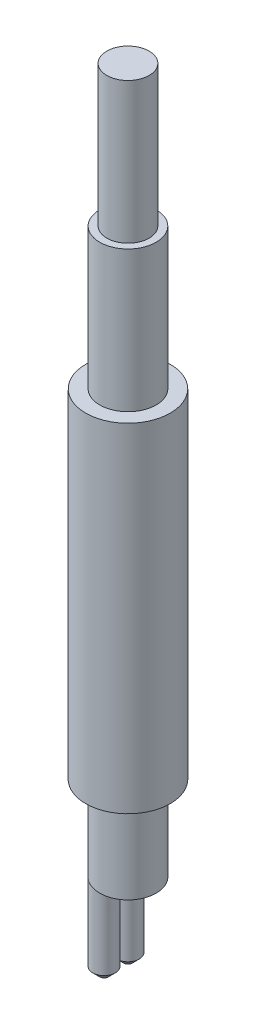
ISO-10303-21;
HEADER;
FILE_DESCRIPTION(('STEP AP214'),'2;1');
FILE_NAME('part.step','',(''),(''),'','','');
FILE_SCHEMA(('AUTOMOTIVE_DESIGN { 1 0 10303 214 1 1 1 1 }'));
ENDSEC;
DATA;
#1=APPLICATION_CONTEXT('core data for automotive mechanical design processes');
#2=APPLICATION_PROTOCOL_DEFINITION('international standard','automotive_design',2000,#1);
#3=PRODUCT_CONTEXT('',#1,'mechanical');
#4=PRODUCT('Part','Part','',(#3));
#5=PRODUCT_RELATED_PRODUCT_CATEGORY('part','',(#4));
#6=PRODUCT_DEFINITION_FORMATION('','',#4);
#7=PRODUCT_DEFINITION_CONTEXT('part definition',#1,'design');
#8=PRODUCT_DEFINITION('design','',#6,#7);
#9=PRODUCT_DEFINITION_SHAPE('','',#8);
#10=(LENGTH_UNIT() NAMED_UNIT(*) SI_UNIT(.MILLI.,.METRE.));
#11=(NAMED_UNIT(*) PLANE_ANGLE_UNIT() SI_UNIT($,.RADIAN.));
#12=(NAMED_UNIT(*) SI_UNIT($,.STERADIAN.) SOLID_ANGLE_UNIT());
#13=UNCERTAINTY_MEASURE_WITH_UNIT(LENGTH_MEASURE(1.E-05),#10,'distance_accuracy_value','');
#14=(GEOMETRIC_REPRESENTATION_CONTEXT(3) GLOBAL_UNCERTAINTY_ASSIGNED_CONTEXT((#13)) GLOBAL_UNIT_ASSIGNED_CONTEXT((#10,
#11,#12)) REPRESENTATION_CONTEXT('',''));
#15=CARTESIAN_POINT('',(0.,0.,0.));
#16=DIRECTION('',(0.,0.,1.));
#17=DIRECTION('',(1.,0.,0.));
#18=AXIS2_PLACEMENT_3D('',#15,#16,#17);
#19=CARTESIAN_POINT('',(0.,15.,0.));
#20=DIRECTION('',(0.,1.,0.));
#21=DIRECTION('',(0.,0.,1.));
#22=AXIS2_PLACEMENT_3D('',#19,#20,#21);
#23=PLANE('',#22);
#24=CARTESIAN_POINT('',(0.,15.,0.));
#25=DIRECTION('',(0.,1.,0.));
#26=DIRECTION('',(0.,0.,1.));
#27=AXIS2_PLACEMENT_3D('',#24,#25,#26);
#28=CIRCLE('',#27,1.5);
#29=CARTESIAN_POINT('',(0.,15.,1.5));
#30=VERTEX_POINT('',#29);
#31=EDGE_CURVE('E12',#30,#30,#28,.T.);
#32=ORIENTED_EDGE('',*,*,#31,.T.);
#33=EDGE_LOOP('',(#32));
#34=FACE_BOUND('',#33,.T.);
#35=CARTESIAN_POINT('',(0.,15.,0.));
#36=DIRECTION('',(0.,1.,0.));
#37=DIRECTION('',(1.,0.,0.));
#38=AXIS2_PLACEMENT_3D('',#35,#36,#37);
#39=CIRCLE('',#38,1.);
#40=CARTESIAN_POINT('',(1.,15.,0.));
#41=VERTEX_POINT('',#40);
#42=EDGE_CURVE('E60',#41,#41,#39,.T.);
#43=ORIENTED_EDGE('',*,*,#42,.F.);
#44=EDGE_LOOP('',(#43));
#45=FACE_BOUND('',#44,.T.);
#46=ADVANCED_FACE('F49',(#34,#45),#23,.T.);
#47=CARTESIAN_POINT('',(0.,3.,0.));
#48=DIRECTION('',(0.,1.,0.));
#49=DIRECTION('',(0.,0.,1.));
#50=AXIS2_PLACEMENT_3D('',#47,#48,#49);
#51=PLANE('',#50);
#52=CARTESIAN_POINT('',(0.,3.,0.));
#53=DIRECTION('',(0.,1.,0.));
#54=DIRECTION('',(0.,0.,1.));
#55=AXIS2_PLACEMENT_3D('',#52,#53,#54);
#56=CIRCLE('',#55,1.5);
#57=CARTESIAN_POINT('',(0.,3.,1.5));
#58=VERTEX_POINT('',#57);
#59=EDGE_CURVE('E53',#58,#58,#56,.T.);
#60=ORIENTED_EDGE('',*,*,#59,.F.);
#61=EDGE_LOOP('',(#60));
#62=FACE_BOUND('',#61,.T.);
#63=CARTESIAN_POINT('',(0.,3.,0.));
#64=DIRECTION('',(0.,1.,0.));
#65=DIRECTION('',(1.,0.,0.));
#66=AXIS2_PLACEMENT_3D('',#63,#64,#65);
#67=CIRCLE('',#66,1.);
#68=CARTESIAN_POINT('',(1.,3.,0.));
#69=VERTEX_POINT('',#68);
#70=EDGE_CURVE('E62',#69,#69,#67,.T.);
#71=ORIENTED_EDGE('',*,*,#70,.T.);
#72=EDGE_LOOP('',(#71));
#73=FACE_BOUND('',#72,.T.);
#74=ADVANCED_FACE('F72',(#62,#73),#51,.F.);
#75=CARTESIAN_POINT('',(0.,15.,0.));
#76=DIRECTION('',(0.,-1.,0.));
#77=DIRECTION('',(0.,0.,-1.));
#78=AXIS2_PLACEMENT_3D('',#75,#76,#77);
#79=CYLINDRICAL_SURFACE('',#78,1.5);
#80=ORIENTED_EDGE('',*,*,#31,.F.);
#81=EDGE_LOOP('',(#80));
#82=FACE_BOUND('',#81,.T.);
#83=ORIENTED_EDGE('',*,*,#59,.T.);
#84=EDGE_LOOP('',(#83));
#85=FACE_BOUND('',#84,.T.);
#86=ADVANCED_FACE('F51',(#82,#85),#79,.T.);
#87=CARTESIAN_POINT('',(0.,15.,0.));
#88=DIRECTION('',(0.,-1.,0.));
#89=DIRECTION('',(0.,0.,-1.));
#90=AXIS2_PLACEMENT_3D('',#87,#88,#89);
#91=CYLINDRICAL_SURFACE('',#90,1.);
#92=ORIENTED_EDGE('',*,*,#42,.T.);
#93=EDGE_LOOP('',(#92));
#94=FACE_BOUND('',#93,.T.);
#95=ORIENTED_EDGE('',*,*,#70,.F.);
#96=EDGE_LOOP('',(#95));
#97=FACE_BOUND('',#96,.T.);
#98=ADVANCED_FACE('F68',(#94,#97),#91,.F.);
#99=CLOSED_SHELL('',(#46,#74,#86,#98));
#100=MANIFOLD_SOLID_BREP('B2',#99);
#101=CARTESIAN_POINT('',(0.,-2.12132034355964,0.));
#102=DIRECTION('',(0.,1.,0.));
#103=DIRECTION('',(0.,0.,1.));
#104=AXIS2_PLACEMENT_3D('',#101,#102,#103);
#105=CYLINDRICAL_SURFACE('',#104,0.75);
#106=CARTESIAN_POINT('',(0.,0.,0.));
#107=DIRECTION('',(0.,1.,0.));
#108=DIRECTION('',(0.,0.,1.));
#109=AXIS2_PLACEMENT_3D('',#106,#107,#108);
#110=CIRCLE('',#109,0.75);
#111=CARTESIAN_POINT('',(0.,0.,0.75));
#112=VERTEX_POINT('',#111);
#113=EDGE_CURVE('E48',#112,#112,#110,.F.);
#114=ORIENTED_EDGE('',*,*,#113,.F.);
#115=EDGE_LOOP('',(#114));
#116=FACE_BOUND('',#115,.T.);
#117=CARTESIAN_POINT('',(0.,25.,0.));
#118=DIRECTION('',(0.,1.,0.));
#119=DIRECTION('',(0.,0.,1.));
#120=AXIS2_PLACEMENT_3D('',#117,#118,#119);
#121=CIRCLE('',#120,0.75);
#122=CARTESIAN_POINT('',(0.,25.,0.75));
#123=VERTEX_POINT('',#122);
#124=EDGE_CURVE('E125',#123,#123,#121,.T.);
#125=ORIENTED_EDGE('',*,*,#124,.F.);
#126=EDGE_LOOP('',(#125));
#127=FACE_BOUND('',#126,.T.);
#128=ADVANCED_FACE('F119',(#116,#127),#105,.T.);
#129=CARTESIAN_POINT('',(0.,0.,0.));
#130=DIRECTION('',(0.,1.,0.));
#131=DIRECTION('',(0.,0.,1.));
#132=AXIS2_PLACEMENT_3D('',#129,#130,#131);
#133=PLANE('',#132);
#134=ORIENTED_EDGE('',*,*,#113,.T.);
#135=EDGE_LOOP('',(#134));
#136=FACE_BOUND('',#135,.T.);
#137=ADVANCED_FACE('F134',(#136),#133,.F.);
#138=CARTESIAN_POINT('',(0.,25.,0.));
#139=DIRECTION('',(0.,1.,0.));
#140=DIRECTION('',(0.,0.,1.));
#141=AXIS2_PLACEMENT_3D('',#138,#139,#140);
#142=PLANE('',#141);
#143=ORIENTED_EDGE('',*,*,#124,.T.);
#144=EDGE_LOOP('',(#143));
#145=FACE_BOUND('',#144,.T.);
#146=ADVANCED_FACE('F131',(#145),#142,.T.);
#147=CLOSED_SHELL('',(#128,#137,#146));
#148=MANIFOLD_SOLID_BREP('B7',#147);
#149=CARTESIAN_POINT('',(0.,0.,0.));
#150=DIRECTION('',(0.,1.,0.));
#151=DIRECTION('',(0.,0.,1.));
#152=AXIS2_PLACEMENT_3D('',#149,#150,#151);
#153=PLANE('',#152);
#154=CARTESIAN_POINT('',(-0.424264068711929,0.,0.424264068711928));
#155=DIRECTION('',(0.,-1.,0.));
#156=DIRECTION('',(0.,0.,1.));
#157=AXIS2_PLACEMENT_3D('',#154,#155,#156);
#158=CIRCLE('',#157,0.4);
#159=CARTESIAN_POINT('',(-0.707106781186549,0.,0.707106781186546));
#160=VERTEX_POINT('',#159);
#161=CARTESIAN_POINT('',(-0.731039274218505,0.,0.167575593539398));
#162=VERTEX_POINT('',#161);
#163=EDGE_CURVE('E174',#160,#162,#158,.T.);
#164=ORIENTED_EDGE('',*,*,#163,.F.);
#165=CARTESIAN_POINT('',(0.,0.,0.));
#166=DIRECTION('',(0.,1.,0.));
#167=DIRECTION('',(0.,0.,1.));
#168=AXIS2_PLACEMENT_3D('',#165,#166,#167);
#169=CIRCLE('',#168,1.);
#170=CARTESIAN_POINT('',(-0.707106781186549,0.,-0.707106781186547));
#171=VERTEX_POINT('',#170);
#172=EDGE_CURVE('E229',#171,#160,#169,.T.);
#173=ORIENTED_EDGE('',*,*,#172,.F.);
#174=CARTESIAN_POINT('',(-0.424264068711929,0.,-0.424264068711928));
#175=DIRECTION('',(0.,-1.,0.));
#176=DIRECTION('',(0.,0.,-1.));
#177=AXIS2_PLACEMENT_3D('',#174,#175,#176);
#178=CIRCLE('',#177,0.4);
#179=CARTESIAN_POINT('',(-0.731039274218505,0.,-0.167575593539398));
#180=VERTEX_POINT('',#179);
#181=EDGE_CURVE('E221',#180,#171,#178,.T.);
#182=ORIENTED_EDGE('',*,*,#181,.F.);
#183=CARTESIAN_POINT('',(0.,0.,0.));
#184=DIRECTION('',(0.,1.,0.));
#185=DIRECTION('',(0.,0.,1.));
#186=AXIS2_PLACEMENT_3D('',#183,#184,#185);
#187=CIRCLE('',#186,0.75);
#188=EDGE_CURVE('E216',#180,#162,#187,.T.);
#189=ORIENTED_EDGE('',*,*,#188,.T.);
#190=EDGE_LOOP('',(#164,#173,#182,#189));
#191=FACE_BOUND('',#190,.T.);
#192=ADVANCED_FACE('F159',(#191),#153,.F.);
#193=CARTESIAN_POINT('',(0.,20.,0.));
#194=DIRECTION('',(0.,1.,0.));
#195=DIRECTION('',(0.,0.,1.));
#196=AXIS2_PLACEMENT_3D('',#193,#194,#195);
#197=PLANE('',#196);
#198=CARTESIAN_POINT('',(0.,20.,0.));
#199=DIRECTION('',(0.,1.,0.));
#200=DIRECTION('',(0.,0.,1.));
#201=AXIS2_PLACEMENT_3D('',#198,#199,#200);
#202=CIRCLE('',#201,1.);
#203=CARTESIAN_POINT('',(0.,20.,1.));
#204=VERTEX_POINT('',#203);
#205=EDGE_CURVE('E226',#204,#204,#202,.T.);
#206=ORIENTED_EDGE('',*,*,#205,.T.);
#207=EDGE_LOOP('',(#206));
#208=FACE_BOUND('',#207,.T.);
#209=CARTESIAN_POINT('',(0.,20.,0.));
#210=DIRECTION('',(0.,1.,0.));
#211=DIRECTION('',(0.,0.,1.));
#212=AXIS2_PLACEMENT_3D('',#209,#210,#211);
#213=CIRCLE('',#212,0.75);
#214=CARTESIAN_POINT('',(0.,20.,0.75));
#215=VERTEX_POINT('',#214);
#216=EDGE_CURVE('E223',#215,#215,#213,.T.);
#217=ORIENTED_EDGE('',*,*,#216,.F.);
#218=EDGE_LOOP('',(#217));
#219=FACE_BOUND('',#218,.T.);
#220=ADVANCED_FACE('F250',(#208,#219),#197,.T.);
#221=CARTESIAN_POINT('',(-0.167575593539401,0.,0.731039274218504));
#222=VERTEX_POINT('',#221);
#223=EDGE_CURVE('E205',#222,#160,#158,.T.);
#224=ORIENTED_EDGE('',*,*,#223,.F.);
#225=CARTESIAN_POINT('',(-0.167575593539401,0.,-0.731039274218504));
#226=VERTEX_POINT('',#225);
#227=EDGE_CURVE('E194',#222,#226,#187,.T.);
#228=ORIENTED_EDGE('',*,*,#227,.T.);
#229=EDGE_CURVE('E222',#171,#226,#178,.T.);
#230=ORIENTED_EDGE('',*,*,#229,.F.);
#231=EDGE_CURVE('E207',#160,#171,#169,.T.);
#232=ORIENTED_EDGE('',*,*,#231,.F.);
#233=EDGE_LOOP('',(#224,#228,#230,#232));
#234=FACE_BOUND('',#233,.T.);
#235=ADVANCED_FACE('F206',(#234),#153,.F.);
#236=CARTESIAN_POINT('',(0.,20.,0.));
#237=DIRECTION('',(0.,-1.,0.));
#238=DIRECTION('',(0.,0.,-1.));
#239=AXIS2_PLACEMENT_3D('',#236,#237,#238);
#240=CYLINDRICAL_SURFACE('',#239,1.);
#241=ORIENTED_EDGE('',*,*,#205,.F.);
#242=EDGE_LOOP('',(#241));
#243=FACE_BOUND('',#242,.T.);
#244=ORIENTED_EDGE('',*,*,#172,.T.);
#245=ORIENTED_EDGE('',*,*,#231,.T.);
#246=EDGE_LOOP('',(#244,#245));
#247=FACE_BOUND('',#246,.T.);
#248=ADVANCED_FACE('F259',(#243,#247),#240,.T.);
#249=CARTESIAN_POINT('',(0.,20.,0.));
#250=DIRECTION('',(0.,-1.,0.));
#251=DIRECTION('',(0.,0.,-1.));
#252=AXIS2_PLACEMENT_3D('',#249,#250,#251);
#253=CYLINDRICAL_SURFACE('',#252,0.75);
#254=ORIENTED_EDGE('',*,*,#216,.T.);
#255=EDGE_LOOP('',(#254));
#256=FACE_BOUND('',#255,.T.);
#257=EDGE_CURVE('E198',#226,#180,#187,.T.);
#258=ORIENTED_EDGE('',*,*,#257,.F.);
#259=ORIENTED_EDGE('',*,*,#227,.F.);
#260=EDGE_CURVE('E182',#162,#222,#187,.T.);
#261=ORIENTED_EDGE('',*,*,#260,.F.);
#262=ORIENTED_EDGE('',*,*,#188,.F.);
#263=EDGE_LOOP('',(#258,#259,#261,#262));
#264=FACE_BOUND('',#263,.T.);
#265=ADVANCED_FACE('F196',(#256,#264),#253,.F.);
#266=CARTESIAN_POINT('',(-0.424264068711929,0.,-0.424264068711928));
#267=DIRECTION('',(0.,-1.,0.));
#268=DIRECTION('',(0.,0.,-1.));
#269=AXIS2_PLACEMENT_3D('',#266,#267,#268);
#270=PLANE('',#269);
#271=EDGE_CURVE('E202',#226,#180,#178,.T.);
#272=ORIENTED_EDGE('',*,*,#271,.F.);
#273=ORIENTED_EDGE('',*,*,#257,.T.);
#274=EDGE_LOOP('',(#272,#273));
#275=FACE_BOUND('',#274,.T.);
#276=ADVANCED_FACE('F267',(#275),#270,.F.);
#277=CARTESIAN_POINT('',(-0.424264068711929,-3.,-0.424264068711928));
#278=DIRECTION('',(0.,1.,0.));
#279=DIRECTION('',(0.,0.,1.));
#280=AXIS2_PLACEMENT_3D('',#277,#278,#279);
#281=CYLINDRICAL_SURFACE('',#280,0.4);
#282=CARTESIAN_POINT('',(-0.424264068711929,-2.75,-0.424264068711928));
#283=DIRECTION('',(0.,-1.,0.));
#284=DIRECTION('',(0.,0.,-1.));
#285=AXIS2_PLACEMENT_3D('',#282,#283,#284);
#286=CIRCLE('',#285,0.4);
#287=CARTESIAN_POINT('',(-0.424264068711929,-2.75,-0.824264068711928));
#288=VERTEX_POINT('',#287);
#289=EDGE_CURVE('E234',#288,#288,#286,.F.);
#290=ORIENTED_EDGE('',*,*,#289,.T.);
#291=EDGE_LOOP('',(#290));
#292=FACE_BOUND('',#291,.T.);
#293=ORIENTED_EDGE('',*,*,#271,.T.);
#294=ORIENTED_EDGE('',*,*,#181,.T.);
#295=ORIENTED_EDGE('',*,*,#229,.T.);
#296=EDGE_LOOP('',(#293,#294,#295));
#297=FACE_BOUND('',#296,.T.);
#298=ADVANCED_FACE('F274',(#292,#297),#281,.T.);
#299=CARTESIAN_POINT('',(-0.424264068711929,-3.,-0.424264068711928));
#300=DIRECTION('',(0.,-1.,0.));
#301=DIRECTION('',(0.,0.,-1.));
#302=AXIS2_PLACEMENT_3D('',#299,#300,#301);
#303=PLANE('',#302);
#304=CARTESIAN_POINT('',(-0.424264068711929,-3.,-0.424264068711928));
#305=DIRECTION('',(0.,-1.,0.));
#306=DIRECTION('',(0.,0.,-1.));
#307=AXIS2_PLACEMENT_3D('',#304,#305,#306);
#308=CIRCLE('',#307,0.149999999999997);
#309=CARTESIAN_POINT('',(-0.424264068711929,-3.,-0.574264068711925));
#310=VERTEX_POINT('',#309);
#311=EDGE_CURVE('E231',#310,#310,#308,.T.);
#312=ORIENTED_EDGE('',*,*,#311,.T.);
#313=EDGE_LOOP('',(#312));
#314=FACE_BOUND('',#313,.T.);
#315=ADVANCED_FACE('F282',(#314),#303,.T.);
#316=CARTESIAN_POINT('',(-0.424264068711929,0.,0.424264068711928));
#317=DIRECTION('',(0.,1.,0.));
#318=DIRECTION('',(0.,0.,1.));
#319=AXIS2_PLACEMENT_3D('',#316,#317,#318);
#320=PLANE('',#319);
#321=EDGE_CURVE('E211',#162,#222,#158,.T.);
#322=ORIENTED_EDGE('',*,*,#321,.F.);
#323=ORIENTED_EDGE('',*,*,#260,.T.);
#324=EDGE_LOOP('',(#322,#323));
#325=FACE_BOUND('',#324,.T.);
#326=ADVANCED_FACE('F215',(#325),#320,.T.);
#327=CARTESIAN_POINT('',(-0.424264068711929,-3.,0.424264068711928));
#328=DIRECTION('',(0.,1.,0.));
#329=DIRECTION('',(0.,0.,1.));
#330=AXIS2_PLACEMENT_3D('',#327,#328,#329);
#331=CYLINDRICAL_SURFACE('',#330,0.4);
#332=CARTESIAN_POINT('',(-0.424264068711929,-2.75,0.424264068711928));
#333=DIRECTION('',(0.,1.,0.));
#334=DIRECTION('',(0.,0.,1.));
#335=AXIS2_PLACEMENT_3D('',#332,#333,#334);
#336=CIRCLE('',#335,0.4);
#337=CARTESIAN_POINT('',(-0.424264068711929,-2.75,0.824264068711928));
#338=VERTEX_POINT('',#337);
#339=EDGE_CURVE('E117',#338,#338,#336,.T.);
#340=ORIENTED_EDGE('',*,*,#339,.T.);
#341=EDGE_LOOP('',(#340));
#342=FACE_BOUND('',#341,.T.);
#343=ORIENTED_EDGE('',*,*,#163,.T.);
#344=ORIENTED_EDGE('',*,*,#321,.T.);
#345=ORIENTED_EDGE('',*,*,#223,.T.);
#346=EDGE_LOOP('',(#343,#344,#345));
#347=FACE_BOUND('',#346,.T.);
#348=ADVANCED_FACE('F217',(#342,#347),#331,.T.);
#349=CARTESIAN_POINT('',(-0.424264068711929,-3.,0.424264068711928));
#350=DIRECTION('',(0.,1.,0.));
#351=DIRECTION('',(0.,0.,1.));
#352=AXIS2_PLACEMENT_3D('',#349,#350,#351);
#353=PLANE('',#352);
#354=CARTESIAN_POINT('',(-0.424264068711929,-3.,0.424264068711928));
#355=DIRECTION('',(0.,1.,0.));
#356=DIRECTION('',(0.,0.,1.));
#357=AXIS2_PLACEMENT_3D('',#354,#355,#356);
#358=CIRCLE('',#357,0.149999999999997);
#359=CARTESIAN_POINT('',(-0.424264068711929,-3.,0.574264068711925));
#360=VERTEX_POINT('',#359);
#361=EDGE_CURVE('E167',#360,#360,#358,.F.);
#362=ORIENTED_EDGE('',*,*,#361,.T.);
#363=EDGE_LOOP('',(#362));
#364=FACE_BOUND('',#363,.T.);
#365=ADVANCED_FACE('F239',(#364),#353,.F.);
#366=CARTESIAN_POINT('',(-0.424264068711929,-3.,-0.424264068711928));
#367=DIRECTION('',(0.,1.,0.));
#368=DIRECTION('',(0.,0.,1.));
#369=AXIS2_PLACEMENT_3D('',#366,#367,#368);
#370=CONICAL_SURFACE('',#369,0.149999999999997,0.785398163397452);
#371=ORIENTED_EDGE('',*,*,#289,.F.);
#372=EDGE_LOOP('',(#371));
#373=FACE_BOUND('',#372,.T.);
#374=ORIENTED_EDGE('',*,*,#311,.F.);
#375=EDGE_LOOP('',(#374));
#376=FACE_BOUND('',#375,.T.);
#377=ADVANCED_FACE('F242',(#373,#376),#370,.T.);
#378=CARTESIAN_POINT('',(-0.424264068711929,-3.,0.424264068711928));
#379=DIRECTION('',(0.,1.,0.));
#380=DIRECTION('',(0.,0.,1.));
#381=AXIS2_PLACEMENT_3D('',#378,#379,#380);
#382=CONICAL_SURFACE('',#381,0.149999999999997,0.785398163397452);
#383=ORIENTED_EDGE('',*,*,#339,.F.);
#384=EDGE_LOOP('',(#383));
#385=FACE_BOUND('',#384,.T.);
#386=ORIENTED_EDGE('',*,*,#361,.F.);
#387=EDGE_LOOP('',(#386));
#388=FACE_BOUND('',#387,.T.);
#389=ADVANCED_FACE('F161',(#385,#388),#382,.T.);
#390=CLOSED_SHELL('',(#192,#220,#235,#248,#265,#276,#298,#315,#326,#348,#365,#377,#389));
#391=MANIFOLD_SOLID_BREP('B43',#390);
#392=ADVANCED_BREP_SHAPE_REPRESENTATION('',(#18,#100,#148,#391),#14);
#393=SHAPE_DEFINITION_REPRESENTATION(#9,#392);
ENDSEC;
END-ISO-10303-21;
